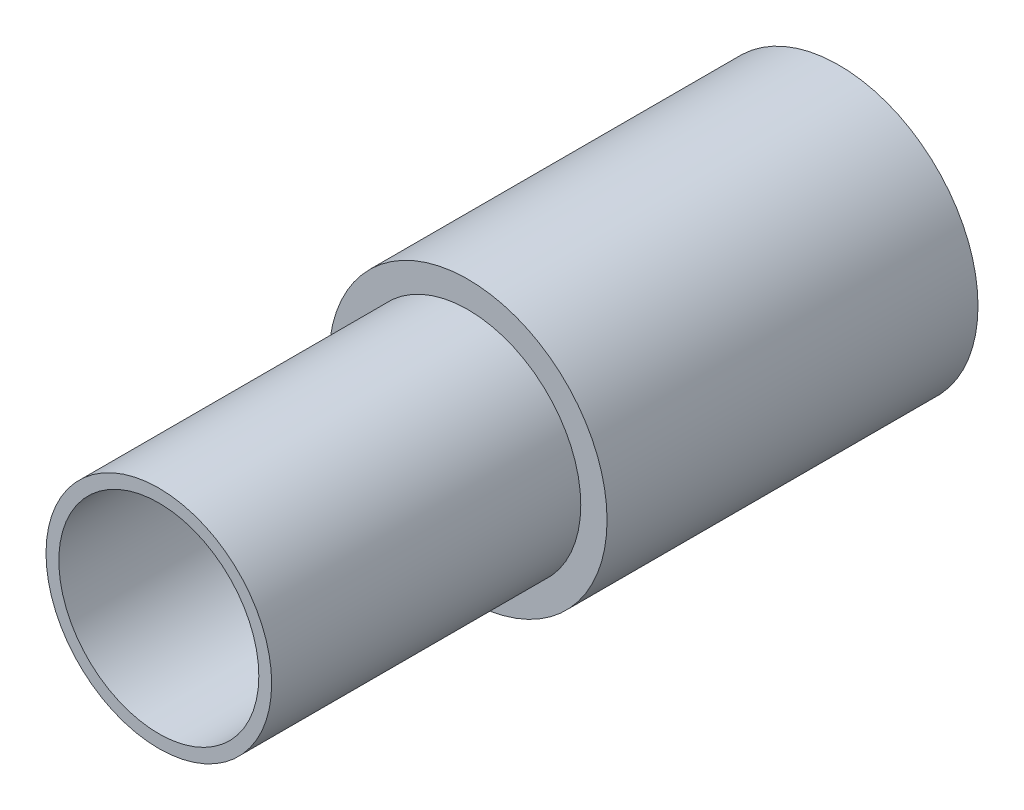
ISO-10303-21;
HEADER;
FILE_DESCRIPTION(('STEP AP214'),'2;1');
FILE_NAME('part.step','',(''),(''),'','','');
FILE_SCHEMA(('AUTOMOTIVE_DESIGN { 1 0 10303 214 1 1 1 1 }'));
ENDSEC;
DATA;
#1=APPLICATION_CONTEXT('core data for automotive mechanical design processes');
#2=APPLICATION_PROTOCOL_DEFINITION('international standard','automotive_design',2000,#1);
#3=PRODUCT_CONTEXT('',#1,'mechanical');
#4=PRODUCT('Part','Part','',(#3));
#5=PRODUCT_RELATED_PRODUCT_CATEGORY('part','',(#4));
#6=PRODUCT_DEFINITION_FORMATION('','',#4);
#7=PRODUCT_DEFINITION_CONTEXT('part definition',#1,'design');
#8=PRODUCT_DEFINITION('design','',#6,#7);
#9=PRODUCT_DEFINITION_SHAPE('','',#8);
#10=(LENGTH_UNIT() NAMED_UNIT(*) SI_UNIT(.MILLI.,.METRE.));
#11=(NAMED_UNIT(*) PLANE_ANGLE_UNIT() SI_UNIT($,.RADIAN.));
#12=(NAMED_UNIT(*) SI_UNIT($,.STERADIAN.) SOLID_ANGLE_UNIT());
#13=UNCERTAINTY_MEASURE_WITH_UNIT(LENGTH_MEASURE(1.E-05),#10,'distance_accuracy_value','');
#14=(GEOMETRIC_REPRESENTATION_CONTEXT(3) GLOBAL_UNCERTAINTY_ASSIGNED_CONTEXT((#13)) GLOBAL_UNIT_ASSIGNED_CONTEXT((#10,
#11,#12)) REPRESENTATION_CONTEXT('',''));
#15=CARTESIAN_POINT('',(0.,0.,0.));
#16=DIRECTION('',(0.,0.,1.));
#17=DIRECTION('',(1.,0.,0.));
#18=AXIS2_PLACEMENT_3D('',#15,#16,#17);
#19=CARTESIAN_POINT('',(0.,0.,10.));
#20=DIRECTION('',(0.,0.,-1.));
#21=DIRECTION('',(-1.,0.,0.));
#22=AXIS2_PLACEMENT_3D('',#19,#20,#21);
#23=CYLINDRICAL_SURFACE('',#22,3.235);
#24=CARTESIAN_POINT('',(0.,0.,10.));
#25=DIRECTION('',(0.,0.,1.));
#26=DIRECTION('',(1.,0.,0.));
#27=AXIS2_PLACEMENT_3D('',#24,#25,#26);
#28=CIRCLE('',#27,3.235);
#29=CARTESIAN_POINT('',(3.235,0.,10.));
#30=VERTEX_POINT('',#29);
#31=EDGE_CURVE('E22',#30,#30,#28,.T.);
#32=ORIENTED_EDGE('',*,*,#31,.T.);
#33=EDGE_LOOP('',(#32));
#34=FACE_BOUND('',#33,.T.);
#35=CARTESIAN_POINT('',(0.,0.,-12.));
#36=DIRECTION('',(0.,0.,1.));
#37=DIRECTION('',(1.,0.,0.));
#38=AXIS2_PLACEMENT_3D('',#35,#36,#37);
#39=CIRCLE('',#38,3.235);
#40=CARTESIAN_POINT('',(3.235,0.,-12.));
#41=VERTEX_POINT('',#40);
#42=EDGE_CURVE('E36',#41,#41,#39,.T.);
#43=ORIENTED_EDGE('',*,*,#42,.F.);
#44=EDGE_LOOP('',(#43));
#45=FACE_BOUND('',#44,.T.);
#46=ADVANCED_FACE('F14',(#34,#45),#23,.F.);
#47=CARTESIAN_POINT('',(0.,0.,10.));
#48=DIRECTION('',(0.,0.,-1.));
#49=DIRECTION('',(-1.,0.,0.));
#50=AXIS2_PLACEMENT_3D('',#47,#48,#49);
#51=CYLINDRICAL_SURFACE('',#50,3.65);
#52=CARTESIAN_POINT('',(0.,0.,10.));
#53=DIRECTION('',(0.,0.,1.));
#54=DIRECTION('',(1.,0.,0.));
#55=AXIS2_PLACEMENT_3D('',#52,#53,#54);
#56=CIRCLE('',#55,3.65);
#57=CARTESIAN_POINT('',(3.65,0.,10.));
#58=VERTEX_POINT('',#57);
#59=EDGE_CURVE('E9',#58,#58,#56,.T.);
#60=ORIENTED_EDGE('',*,*,#59,.F.);
#61=EDGE_LOOP('',(#60));
#62=FACE_BOUND('',#61,.T.);
#63=CARTESIAN_POINT('',(0.,0.,0.));
#64=DIRECTION('',(0.,0.,1.));
#65=DIRECTION('',(1.,0.,0.));
#66=AXIS2_PLACEMENT_3D('',#63,#64,#65);
#67=CIRCLE('',#66,3.65);
#68=CARTESIAN_POINT('',(3.65,0.,0.));
#69=VERTEX_POINT('',#68);
#70=EDGE_CURVE('E17',#69,#69,#67,.T.);
#71=ORIENTED_EDGE('',*,*,#70,.T.);
#72=EDGE_LOOP('',(#71));
#73=FACE_BOUND('',#72,.T.);
#74=ADVANCED_FACE('F50',(#62,#73),#51,.T.);
#75=CARTESIAN_POINT('',(0.,0.,10.));
#76=DIRECTION('',(0.,0.,1.));
#77=DIRECTION('',(1.,0.,0.));
#78=AXIS2_PLACEMENT_3D('',#75,#76,#77);
#79=PLANE('',#78);
#80=ORIENTED_EDGE('',*,*,#31,.F.);
#81=EDGE_LOOP('',(#80));
#82=FACE_BOUND('',#81,.T.);
#83=ORIENTED_EDGE('',*,*,#59,.T.);
#84=EDGE_LOOP('',(#83));
#85=FACE_BOUND('',#84,.T.);
#86=ADVANCED_FACE('F56',(#82,#85),#79,.T.);
#87=CARTESIAN_POINT('',(0.,0.,-12.));
#88=DIRECTION('',(0.,0.,1.));
#89=DIRECTION('',(1.,0.,0.));
#90=AXIS2_PLACEMENT_3D('',#87,#88,#89);
#91=CYLINDRICAL_SURFACE('',#90,4.5);
#92=CARTESIAN_POINT('',(0.,0.,-12.));
#93=DIRECTION('',(0.,0.,1.));
#94=DIRECTION('',(1.,0.,0.));
#95=AXIS2_PLACEMENT_3D('',#92,#93,#94);
#96=CIRCLE('',#95,4.5);
#97=CARTESIAN_POINT('',(4.5,0.,-12.));
#98=VERTEX_POINT('',#97);
#99=EDGE_CURVE('E37',#98,#98,#96,.T.);
#100=ORIENTED_EDGE('',*,*,#99,.T.);
#101=EDGE_LOOP('',(#100));
#102=FACE_BOUND('',#101,.T.);
#103=CARTESIAN_POINT('',(0.,0.,0.));
#104=DIRECTION('',(0.,0.,1.));
#105=DIRECTION('',(1.,0.,0.));
#106=AXIS2_PLACEMENT_3D('',#103,#104,#105);
#107=CIRCLE('',#106,4.5);
#108=CARTESIAN_POINT('',(4.5,0.,0.));
#109=VERTEX_POINT('',#108);
#110=EDGE_CURVE('E32',#109,#109,#107,.T.);
#111=ORIENTED_EDGE('',*,*,#110,.F.);
#112=EDGE_LOOP('',(#111));
#113=FACE_BOUND('',#112,.T.);
#114=ADVANCED_FACE('F61',(#102,#113),#91,.T.);
#115=CARTESIAN_POINT('',(0.,0.,-12.));
#116=DIRECTION('',(0.,0.,1.));
#117=DIRECTION('',(1.,0.,0.));
#118=AXIS2_PLACEMENT_3D('',#115,#116,#117);
#119=PLANE('',#118);
#120=ORIENTED_EDGE('',*,*,#42,.T.);
#121=EDGE_LOOP('',(#120));
#122=FACE_BOUND('',#121,.T.);
#123=ORIENTED_EDGE('',*,*,#99,.F.);
#124=EDGE_LOOP('',(#123));
#125=FACE_BOUND('',#124,.T.);
#126=ADVANCED_FACE('F46',(#122,#125),#119,.F.);
#127=CARTESIAN_POINT('',(0.,0.,0.));
#128=DIRECTION('',(0.,0.,1.));
#129=DIRECTION('',(1.,0.,0.));
#130=AXIS2_PLACEMENT_3D('',#127,#128,#129);
#131=PLANE('',#130);
#132=ORIENTED_EDGE('',*,*,#70,.F.);
#133=EDGE_LOOP('',(#132));
#134=FACE_BOUND('',#133,.T.);
#135=ORIENTED_EDGE('',*,*,#110,.T.);
#136=EDGE_LOOP('',(#135));
#137=FACE_BOUND('',#136,.T.);
#138=ADVANCED_FACE('F68',(#134,#137),#131,.T.);
#139=CLOSED_SHELL('',(#46,#74,#86,#114,#126,#138));
#140=MANIFOLD_SOLID_BREP('B1',#139);
#141=ADVANCED_BREP_SHAPE_REPRESENTATION('',(#18,#140),#14);
#142=SHAPE_DEFINITION_REPRESENTATION(#9,#141);
ENDSEC;
END-ISO-10303-21;
